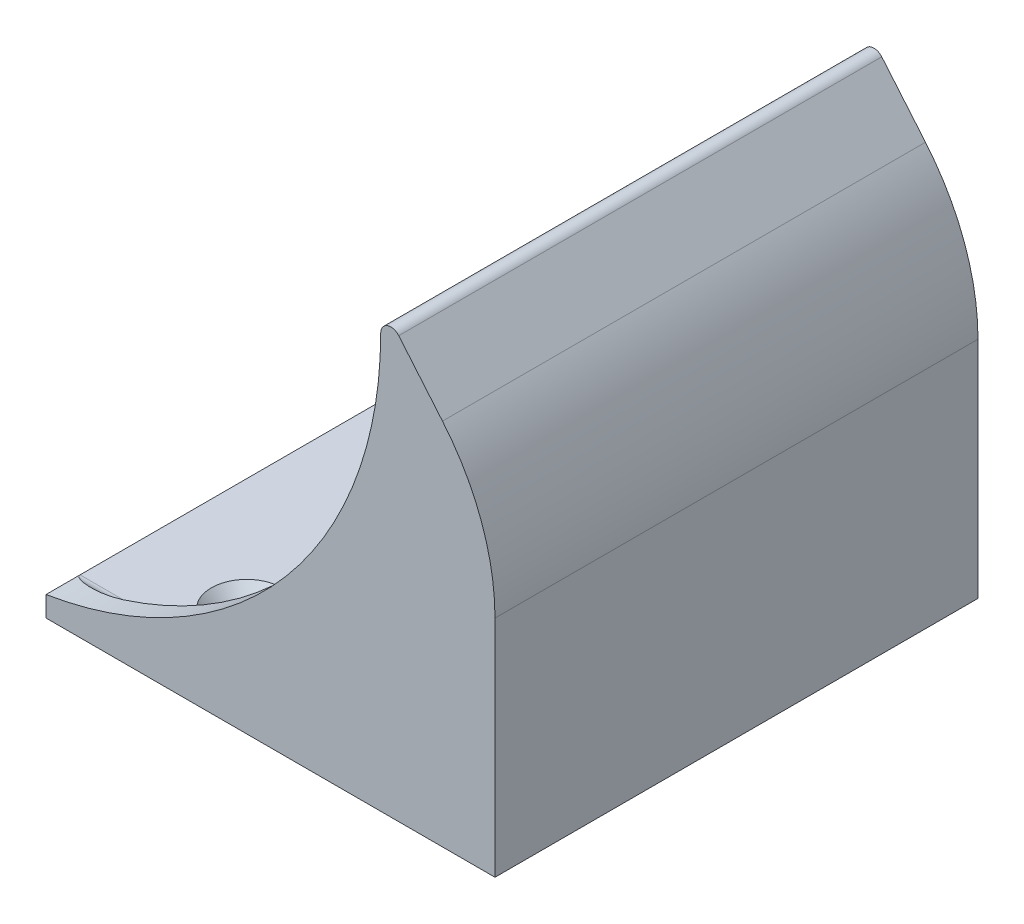
ISO-10303-21;
HEADER;
FILE_DESCRIPTION(('STEP AP214'),'2;1');
FILE_NAME('part.step','',(''),(''),'','','');
FILE_SCHEMA(('AUTOMOTIVE_DESIGN { 1 0 10303 214 1 1 1 1 }'));
ENDSEC;
DATA;
#1=APPLICATION_CONTEXT('core data for automotive mechanical design processes');
#2=APPLICATION_PROTOCOL_DEFINITION('international standard','automotive_design',2000,#1);
#3=PRODUCT_CONTEXT('',#1,'mechanical');
#4=PRODUCT('Part','Part','',(#3));
#5=PRODUCT_RELATED_PRODUCT_CATEGORY('part','',(#4));
#6=PRODUCT_DEFINITION_FORMATION('','',#4);
#7=PRODUCT_DEFINITION_CONTEXT('part definition',#1,'design');
#8=PRODUCT_DEFINITION('design','',#6,#7);
#9=PRODUCT_DEFINITION_SHAPE('','',#8);
#10=(LENGTH_UNIT() NAMED_UNIT(*) SI_UNIT(.MILLI.,.METRE.));
#11=(NAMED_UNIT(*) PLANE_ANGLE_UNIT() SI_UNIT($,.RADIAN.));
#12=(NAMED_UNIT(*) SI_UNIT($,.STERADIAN.) SOLID_ANGLE_UNIT());
#13=UNCERTAINTY_MEASURE_WITH_UNIT(LENGTH_MEASURE(1.E-05),#10,'distance_accuracy_value','');
#14=(GEOMETRIC_REPRESENTATION_CONTEXT(3) GLOBAL_UNCERTAINTY_ASSIGNED_CONTEXT((#13)) GLOBAL_UNIT_ASSIGNED_CONTEXT((#10,
#11,#12)) REPRESENTATION_CONTEXT('',''));
#15=CARTESIAN_POINT('',(0.,0.,0.));
#16=DIRECTION('',(0.,0.,1.));
#17=DIRECTION('',(1.,0.,0.));
#18=AXIS2_PLACEMENT_3D('',#15,#16,#17);
#19=CARTESIAN_POINT('',(0.,0.,32.5));
#20=DIRECTION('',(0.,0.,-1.));
#21=DIRECTION('',(-1.,0.,0.));
#22=AXIS2_PLACEMENT_3D('',#19,#20,#21);
#23=CYLINDRICAL_SURFACE('',#22,30.);
#24=DIRECTION('',(0.,0.,-1.));
#25=VECTOR('',#24,1.);
#26=CARTESIAN_POINT('',(0.,-30.,32.5));
#27=LINE('',#26,#25);
#28=CARTESIAN_POINT('',(0.,-30.,30.5));
#29=VERTEX_POINT('',#28);
#30=CARTESIAN_POINT('',(0.,-30.,-30.5));
#31=VERTEX_POINT('',#30);
#32=EDGE_CURVE('E351',#29,#31,#27,.T.);
#33=ORIENTED_EDGE('',*,*,#32,.F.);
#34=CARTESIAN_POINT('',(0.,0.,30.5));
#35=DIRECTION('',(0.,0.,1.));
#36=DIRECTION('',(1.,0.,0.));
#37=AXIS2_PLACEMENT_3D('',#34,#35,#36);
#38=CIRCLE('',#37,30.);
#39=CARTESIAN_POINT('',(22.9813332935692,19.2836282905963,30.5));
#40=VERTEX_POINT('',#39);
#41=EDGE_CURVE('E373',#29,#40,#38,.T.);
#42=ORIENTED_EDGE('',*,*,#41,.T.);
#43=DIRECTION('',(0.,0.,-1.));
#44=VECTOR('',#43,1.);
#45=CARTESIAN_POINT('',(22.9813332935692,19.2836282905963,32.5));
#46=LINE('',#45,#44);
#47=CARTESIAN_POINT('',(22.9813332935692,19.2836282905963,-30.5));
#48=VERTEX_POINT('',#47);
#49=EDGE_CURVE('E328',#40,#48,#46,.T.);
#50=ORIENTED_EDGE('',*,*,#49,.T.);
#51=CARTESIAN_POINT('',(0.,0.,-30.5));
#52=DIRECTION('',(0.,0.,1.));
#53=DIRECTION('',(1.,0.,0.));
#54=AXIS2_PLACEMENT_3D('',#51,#52,#53);
#55=CIRCLE('',#54,30.);
#56=EDGE_CURVE('E218',#31,#48,#55,.T.);
#57=ORIENTED_EDGE('',*,*,#56,.F.);
#58=EDGE_LOOP('',(#33,#42,#50,#57));
#59=FACE_BOUND('',#58,.T.);
#60=ADVANCED_FACE('F38',(#59),#23,.F.);
#61=CARTESIAN_POINT('',(-33.,-30.,32.5));
#62=DIRECTION('',(0.,-1.,0.));
#63=DIRECTION('',(0.,0.,-1.));
#64=AXIS2_PLACEMENT_3D('',#61,#62,#63);
#65=PLANE('',#64);
#66=CARTESIAN_POINT('',(-16.5,-30.,22.5));
#67=DIRECTION('',(0.,1.,0.));
#68=DIRECTION('',(0.,0.,1.));
#69=AXIS2_PLACEMENT_3D('',#66,#67,#68);
#70=CIRCLE('',#69,5.2);
#71=CARTESIAN_POINT('',(-16.5,-30.,27.7));
#72=VERTEX_POINT('',#71);
#73=EDGE_CURVE('E280',#72,#72,#70,.T.);
#74=ORIENTED_EDGE('',*,*,#73,.F.);
#75=EDGE_LOOP('',(#74));
#76=FACE_BOUND('',#75,.T.);
#77=DIRECTION('',(0.,0.,-1.));
#78=VECTOR('',#77,1.);
#79=CARTESIAN_POINT('',(-33.,-30.,32.5));
#80=LINE('',#79,#78);
#81=CARTESIAN_POINT('',(-33.,-30.,30.5));
#82=VERTEX_POINT('',#81);
#83=CARTESIAN_POINT('',(-33.,-30.,-30.5));
#84=VERTEX_POINT('',#83);
#85=EDGE_CURVE('E185',#82,#84,#80,.T.);
#86=ORIENTED_EDGE('',*,*,#85,.F.);
#87=DIRECTION('',(-1.,0.,0.));
#88=VECTOR('',#87,1.);
#89=CARTESIAN_POINT('',(0.,-30.,30.5));
#90=LINE('',#89,#88);
#91=EDGE_CURVE('E370',#82,#29,#90,.F.);
#92=ORIENTED_EDGE('',*,*,#91,.T.);
#93=ORIENTED_EDGE('',*,*,#32,.T.);
#94=DIRECTION('',(-1.,0.,0.));
#95=VECTOR('',#94,1.);
#96=CARTESIAN_POINT('',(0.,-30.,-30.5));
#97=LINE('',#96,#95);
#98=EDGE_CURVE('E214',#84,#31,#97,.F.);
#99=ORIENTED_EDGE('',*,*,#98,.F.);
#100=EDGE_LOOP('',(#86,#92,#93,#99));
#101=FACE_BOUND('',#100,.T.);
#102=CARTESIAN_POINT('',(-16.5,-30.,-22.5));
#103=DIRECTION('',(0.,-1.,0.));
#104=DIRECTION('',(0.,0.,-1.));
#105=AXIS2_PLACEMENT_3D('',#102,#103,#104);
#106=CIRCLE('',#105,5.2);
#107=CARTESIAN_POINT('',(-16.5,-30.,-27.7));
#108=VERTEX_POINT('',#107);
#109=EDGE_CURVE('E279',#108,#108,#106,.T.);
#110=ORIENTED_EDGE('',*,*,#109,.T.);
#111=EDGE_LOOP('',(#110));
#112=FACE_BOUND('',#111,.T.);
#113=ADVANCED_FACE('F457',(#76,#101,#112),#65,.F.);
#114=CARTESIAN_POINT('',(-33.,-33.,32.5));
#115=DIRECTION('',(1.,0.,0.));
#116=DIRECTION('',(0.,0.,-1.));
#117=AXIS2_PLACEMENT_3D('',#114,#115,#116);
#118=PLANE('',#117);
#119=ORIENTED_EDGE('',*,*,#85,.T.);
#120=DIRECTION('',(0.,0.,1.));
#121=VECTOR('',#120,1.);
#122=CARTESIAN_POINT('',(-33.,-30.,-35.5));
#123=LINE('',#122,#121);
#124=CARTESIAN_POINT('',(-33.,-30.,-35.5));
#125=VERTEX_POINT('',#124);
#126=EDGE_CURVE('E165',#125,#84,#123,.T.);
#127=ORIENTED_EDGE('',*,*,#126,.F.);
#128=DIRECTION('',(0.,-1.,0.));
#129=VECTOR('',#128,1.);
#130=CARTESIAN_POINT('',(-33.,-30.,-35.5));
#131=LINE('',#130,#129);
#132=CARTESIAN_POINT('',(-33.,-33.,-35.5));
#133=VERTEX_POINT('',#132);
#134=EDGE_CURVE('E173',#125,#133,#131,.T.);
#135=ORIENTED_EDGE('',*,*,#134,.T.);
#136=DIRECTION('',(0.,0.,-1.));
#137=VECTOR('',#136,1.);
#138=CARTESIAN_POINT('',(-33.,-33.,32.5));
#139=LINE('',#138,#137);
#140=CARTESIAN_POINT('',(-33.,-33.,35.5));
#141=VERTEX_POINT('',#140);
#142=EDGE_CURVE('E346',#141,#133,#139,.T.);
#143=ORIENTED_EDGE('',*,*,#142,.F.);
#144=DIRECTION('',(0.,-1.,0.));
#145=VECTOR('',#144,1.);
#146=CARTESIAN_POINT('',(-33.,-30.,35.5));
#147=LINE('',#146,#145);
#148=CARTESIAN_POINT('',(-33.,-30.,35.5));
#149=VERTEX_POINT('',#148);
#150=EDGE_CURVE('E297',#149,#141,#147,.T.);
#151=ORIENTED_EDGE('',*,*,#150,.F.);
#152=DIRECTION('',(0.,0.,-1.));
#153=VECTOR('',#152,1.);
#154=CARTESIAN_POINT('',(-33.,-30.,35.5));
#155=LINE('',#154,#153);
#156=EDGE_CURVE('E57',#149,#82,#155,.T.);
#157=ORIENTED_EDGE('',*,*,#156,.T.);
#158=EDGE_LOOP('',(#119,#127,#135,#143,#151,#157));
#159=FACE_BOUND('',#158,.T.);
#160=ADVANCED_FACE('F184',(#159),#118,.F.);
#161=CARTESIAN_POINT('',(33.,-33.,32.5));
#162=DIRECTION('',(0.,1.,0.));
#163=DIRECTION('',(-1.,0.,0.));
#164=AXIS2_PLACEMENT_3D('',#161,#162,#163);
#165=PLANE('',#164);
#166=CARTESIAN_POINT('',(-16.5,-33.,22.5));
#167=DIRECTION('',(0.,1.,0.));
#168=DIRECTION('',(0.,0.,1.));
#169=AXIS2_PLACEMENT_3D('',#166,#167,#168);
#170=CIRCLE('',#169,2.9);
#171=CARTESIAN_POINT('',(-16.5,-33.,25.4));
#172=VERTEX_POINT('',#171);
#173=EDGE_CURVE('E288',#172,#172,#170,.T.);
#174=ORIENTED_EDGE('',*,*,#173,.T.);
#175=EDGE_LOOP('',(#174));
#176=FACE_BOUND('',#175,.T.);
#177=ORIENTED_EDGE('',*,*,#142,.T.);
#178=DIRECTION('',(1.,0.,0.));
#179=VECTOR('',#178,1.);
#180=CARTESIAN_POINT('',(-33.,-33.,-35.5));
#181=LINE('',#180,#179);
#182=CARTESIAN_POINT('',(33.,-33.,-35.5));
#183=VERTEX_POINT('',#182);
#184=EDGE_CURVE('E181',#133,#183,#181,.T.);
#185=ORIENTED_EDGE('',*,*,#184,.T.);
#186=DIRECTION('',(0.,0.,-1.));
#187=VECTOR('',#186,1.);
#188=CARTESIAN_POINT('',(33.,-33.,32.5));
#189=LINE('',#188,#187);
#190=CARTESIAN_POINT('',(33.,-33.,35.5));
#191=VERTEX_POINT('',#190);
#192=EDGE_CURVE('E343',#191,#183,#189,.T.);
#193=ORIENTED_EDGE('',*,*,#192,.F.);
#194=DIRECTION('',(1.,0.,0.));
#195=VECTOR('',#194,1.);
#196=CARTESIAN_POINT('',(-33.,-33.,35.5));
#197=LINE('',#196,#195);
#198=EDGE_CURVE('E301',#141,#191,#197,.T.);
#199=ORIENTED_EDGE('',*,*,#198,.F.);
#200=EDGE_LOOP('',(#177,#185,#193,#199));
#201=FACE_BOUND('',#200,.T.);
#202=CARTESIAN_POINT('',(-16.5,-33.,-22.5));
#203=DIRECTION('',(0.,-1.,0.));
#204=DIRECTION('',(0.,0.,-1.));
#205=AXIS2_PLACEMENT_3D('',#202,#203,#204);
#206=CIRCLE('',#205,2.9);
#207=CARTESIAN_POINT('',(-16.5,-33.,-25.4));
#208=VERTEX_POINT('',#207);
#209=EDGE_CURVE('E463',#208,#208,#206,.T.);
#210=ORIENTED_EDGE('',*,*,#209,.F.);
#211=EDGE_LOOP('',(#210));
#212=FACE_BOUND('',#211,.T.);
#213=ADVANCED_FACE('F511',(#176,#201,#212),#165,.F.);
#214=CARTESIAN_POINT('',(33.,0.,32.5));
#215=DIRECTION('',(-1.,0.,0.));
#216=DIRECTION('',(0.,-1.,0.));
#217=AXIS2_PLACEMENT_3D('',#214,#215,#216);
#218=PLANE('',#217);
#219=ORIENTED_EDGE('',*,*,#192,.T.);
#220=DIRECTION('',(0.,1.,0.));
#221=VECTOR('',#220,1.);
#222=CARTESIAN_POINT('',(33.,-33.,-35.5));
#223=LINE('',#222,#221);
#224=CARTESIAN_POINT('',(33.,0.,-35.5));
#225=VERTEX_POINT('',#224);
#226=EDGE_CURVE('E479',#183,#225,#223,.T.);
#227=ORIENTED_EDGE('',*,*,#226,.T.);
#228=DIRECTION('',(0.,0.,-1.));
#229=VECTOR('',#228,1.);
#230=CARTESIAN_POINT('',(33.,0.,32.5));
#231=LINE('',#230,#229);
#232=CARTESIAN_POINT('',(33.,0.,35.5));
#233=VERTEX_POINT('',#232);
#234=EDGE_CURVE('E340',#233,#225,#231,.T.);
#235=ORIENTED_EDGE('',*,*,#234,.F.);
#236=DIRECTION('',(0.,1.,0.));
#237=VECTOR('',#236,1.);
#238=CARTESIAN_POINT('',(33.,-33.,35.5));
#239=LINE('',#238,#237);
#240=EDGE_CURVE('E305',#191,#233,#239,.T.);
#241=ORIENTED_EDGE('',*,*,#240,.F.);
#242=EDGE_LOOP('',(#219,#227,#235,#241));
#243=FACE_BOUND('',#242,.T.);
#244=ADVANCED_FACE('F514',(#243),#218,.F.);
#245=CARTESIAN_POINT('',(0.,0.,32.5));
#246=DIRECTION('',(0.,0.,-1.));
#247=DIRECTION('',(-1.,0.,0.));
#248=AXIS2_PLACEMENT_3D('',#245,#246,#247);
#249=CYLINDRICAL_SURFACE('',#248,33.);
#250=ORIENTED_EDGE('',*,*,#234,.T.);
#251=CARTESIAN_POINT('',(0.,0.,-35.5));
#252=DIRECTION('',(0.,0.,1.));
#253=DIRECTION('',(1.,0.,0.));
#254=AXIS2_PLACEMENT_3D('',#251,#252,#253);
#255=CIRCLE('',#254,33.);
#256=CARTESIAN_POINT('',(25.2794666229262,21.2119911196559,-35.5));
#257=VERTEX_POINT('',#256);
#258=EDGE_CURVE('E475',#225,#257,#255,.T.);
#259=ORIENTED_EDGE('',*,*,#258,.T.);
#260=DIRECTION('',(0.,0.,-1.));
#261=VECTOR('',#260,1.);
#262=CARTESIAN_POINT('',(25.2794666229261,21.2119911196559,32.5));
#263=LINE('',#262,#261);
#264=CARTESIAN_POINT('',(25.2794666229262,21.2119911196559,35.5));
#265=VERTEX_POINT('',#264);
#266=EDGE_CURVE('E337',#265,#257,#263,.T.);
#267=ORIENTED_EDGE('',*,*,#266,.F.);
#268=CARTESIAN_POINT('',(0.,0.,35.5));
#269=DIRECTION('',(0.,0.,1.));
#270=DIRECTION('',(1.,0.,0.));
#271=AXIS2_PLACEMENT_3D('',#268,#269,#270);
#272=CIRCLE('',#271,33.);
#273=EDGE_CURVE('E309',#233,#265,#272,.T.);
#274=ORIENTED_EDGE('',*,*,#273,.F.);
#275=EDGE_LOOP('',(#250,#259,#267,#274));
#276=FACE_BOUND('',#275,.T.);
#277=ADVANCED_FACE('F518',(#276),#249,.T.);
#278=CARTESIAN_POINT('',(25.2794666229261,21.2119911196559,32.5));
#279=DIRECTION('',(-0.766044443118974,-0.642787609686543,0.));
#280=DIRECTION('',(0.642787609686543,-0.766044443118975,0.));
#281=AXIS2_PLACEMENT_3D('',#278,#279,#280);
#282=PLANE('',#281);
#283=ORIENTED_EDGE('',*,*,#266,.T.);
#284=DIRECTION('',(-0.642787609686543,0.766044443118975,0.));
#285=VECTOR('',#284,1.);
#286=CARTESIAN_POINT('',(25.2794666229261,21.2119911196559,-35.5));
#287=LINE('',#286,#285);
#288=CARTESIAN_POINT('',(18.8515905260607,28.8724355508457,-35.5));
#289=VERTEX_POINT('',#288);
#290=EDGE_CURVE('E471',#257,#289,#287,.T.);
#291=ORIENTED_EDGE('',*,*,#290,.T.);
#292=DIRECTION('',(0.,0.,-1.));
#293=VECTOR('',#292,1.);
#294=CARTESIAN_POINT('',(18.8515905260607,28.8724355508457,32.5));
#295=LINE('',#294,#293);
#296=CARTESIAN_POINT('',(18.8515905260607,28.8724355508457,35.5));
#297=VERTEX_POINT('',#296);
#298=EDGE_CURVE('E334',#297,#289,#295,.T.);
#299=ORIENTED_EDGE('',*,*,#298,.F.);
#300=DIRECTION('',(-0.642787609686543,0.766044443118975,0.));
#301=VECTOR('',#300,1.);
#302=CARTESIAN_POINT('',(25.2794666229261,21.2119911196559,35.5));
#303=LINE('',#302,#301);
#304=EDGE_CURVE('E313',#265,#297,#303,.T.);
#305=ORIENTED_EDGE('',*,*,#304,.F.);
#306=EDGE_LOOP('',(#283,#291,#299,#305));
#307=FACE_BOUND('',#306,.T.);
#308=ADVANCED_FACE('F522',(#307),#282,.F.);
#309=CARTESIAN_POINT('',(17.7025238613823,27.9082541363159,32.5));
#310=DIRECTION('',(0.,0.,-1.));
#311=DIRECTION('',(-1.,0.,0.));
#312=AXIS2_PLACEMENT_3D('',#309,#310,#311);
#313=CYLINDRICAL_SURFACE('',#312,1.5);
#314=DIRECTION('',(0.,0.,-1.));
#315=VECTOR('',#314,1.);
#316=CARTESIAN_POINT('',(16.5534571967038,26.9440727217861,32.5));
#317=LINE('',#316,#315);
#318=CARTESIAN_POINT('',(16.5534571967038,26.9440727217861,30.5));
#319=VERTEX_POINT('',#318);
#320=CARTESIAN_POINT('',(16.5534571967038,26.9440727217861,-30.5));
#321=VERTEX_POINT('',#320);
#322=EDGE_CURVE('E331',#319,#321,#317,.T.);
#323=ORIENTED_EDGE('',*,*,#322,.F.);
#324=CARTESIAN_POINT('',(17.7025238613823,27.9082541363159,30.5));
#325=DIRECTION('',(0.,0.,1.));
#326=DIRECTION('',(1.,0.,0.));
#327=AXIS2_PLACEMENT_3D('',#324,#325,#326);
#328=CIRCLE('',#327,1.5);
#329=CARTESIAN_POINT('',(16.2025238613822,27.9082541363159,30.5));
#330=VERTEX_POINT('',#329);
#331=EDGE_CURVE('E354',#319,#330,#328,.F.);
#332=ORIENTED_EDGE('',*,*,#331,.T.);
#333=DIRECTION('',(0.,0.,-1.));
#334=VECTOR('',#333,1.);
#335=CARTESIAN_POINT('',(16.2025238613822,27.9082541363159,35.5));
#336=LINE('',#335,#334);
#337=CARTESIAN_POINT('',(16.2025238613822,27.9082541363159,35.5));
#338=VERTEX_POINT('',#337);
#339=EDGE_CURVE('E320',#338,#330,#336,.T.);
#340=ORIENTED_EDGE('',*,*,#339,.F.);
#341=CARTESIAN_POINT('',(17.7025238613823,27.9082541363159,35.5));
#342=DIRECTION('',(0.,0.,1.));
#343=DIRECTION('',(1.,0.,0.));
#344=AXIS2_PLACEMENT_3D('',#341,#342,#343);
#345=CIRCLE('',#344,1.5);
#346=EDGE_CURVE('E317',#297,#338,#345,.T.);
#347=ORIENTED_EDGE('',*,*,#346,.F.);
#348=ORIENTED_EDGE('',*,*,#298,.T.);
#349=CARTESIAN_POINT('',(17.7025238613823,27.9082541363159,-35.5));
#350=DIRECTION('',(0.,0.,1.));
#351=DIRECTION('',(1.,0.,0.));
#352=AXIS2_PLACEMENT_3D('',#349,#350,#351);
#353=CIRCLE('',#352,1.5);
#354=CARTESIAN_POINT('',(16.2025238613822,27.9082541363159,-35.5));
#355=VERTEX_POINT('',#354);
#356=EDGE_CURVE('E195',#289,#355,#353,.T.);
#357=ORIENTED_EDGE('',*,*,#356,.T.);
#358=DIRECTION('',(0.,0.,1.));
#359=VECTOR('',#358,1.);
#360=CARTESIAN_POINT('',(16.2025238613822,27.9082541363159,-35.5));
#361=LINE('',#360,#359);
#362=CARTESIAN_POINT('',(16.2025238613822,27.9082541363159,-30.5));
#363=VERTEX_POINT('',#362);
#364=EDGE_CURVE('E168',#355,#363,#361,.T.);
#365=ORIENTED_EDGE('',*,*,#364,.T.);
#366=CARTESIAN_POINT('',(17.7025238613823,27.9082541363159,-30.5));
#367=DIRECTION('',(0.,0.,1.));
#368=DIRECTION('',(1.,0.,0.));
#369=AXIS2_PLACEMENT_3D('',#366,#367,#368);
#370=CIRCLE('',#369,1.5);
#371=EDGE_CURVE('E188',#321,#363,#370,.F.);
#372=ORIENTED_EDGE('',*,*,#371,.F.);
#373=EDGE_LOOP('',(#323,#332,#340,#347,#348,#357,#365,#372));
#374=FACE_BOUND('',#373,.T.);
#375=ADVANCED_FACE('F439',(#374),#313,.T.);
#376=CARTESIAN_POINT('',(22.9813332935692,19.2836282905963,32.5));
#377=DIRECTION('',(0.766044443118974,0.642787609686544,0.));
#378=DIRECTION('',(-0.642787609686544,0.766044443118974,0.));
#379=AXIS2_PLACEMENT_3D('',#376,#377,#378);
#380=PLANE('',#379);
#381=ORIENTED_EDGE('',*,*,#49,.F.);
#382=DIRECTION('',(0.642787609686544,-0.766044443118974,0.));
#383=VECTOR('',#382,1.);
#384=CARTESIAN_POINT('',(16.5534571967038,26.9440727217861,30.5));
#385=LINE('',#384,#383);
#386=EDGE_CURVE('E367',#40,#319,#385,.F.);
#387=ORIENTED_EDGE('',*,*,#386,.T.);
#388=ORIENTED_EDGE('',*,*,#322,.T.);
#389=DIRECTION('',(0.642787609686544,-0.766044443118974,0.));
#390=VECTOR('',#389,1.);
#391=CARTESIAN_POINT('',(16.5534571967038,26.9440727217861,-30.5));
#392=LINE('',#391,#390);
#393=EDGE_CURVE('E210',#48,#321,#392,.F.);
#394=ORIENTED_EDGE('',*,*,#393,.F.);
#395=EDGE_LOOP('',(#381,#387,#388,#394));
#396=FACE_BOUND('',#395,.T.);
#397=ADVANCED_FACE('F400',(#396),#380,.F.);
#398=CARTESIAN_POINT('',(-42.4759116972664,27.9082541363153,32.5));
#399=DIRECTION('',(0.,0.,1.));
#400=DIRECTION('',(1.,0.,0.));
#401=AXIS2_PLACEMENT_3D('',#398,#399,#400);
#402=PLANE('',#401);
#403=CARTESIAN_POINT('',(-42.4759116972664,27.9082541363153,32.5));
#404=DIRECTION('',(0.,0.,-1.));
#405=DIRECTION('',(1.,0.,0.));
#406=AXIS2_PLACEMENT_3D('',#403,#404,#405);
#407=CIRCLE('',#406,58.6784355586486);
#408=CARTESIAN_POINT('',(16.0962059800786,24.3775558481964,32.5));
#409=VERTEX_POINT('',#408);
#410=CARTESIAN_POINT('',(-24.6594608992075,-28.,32.5));
#411=VERTEX_POINT('',#410);
#412=EDGE_CURVE('E292',#409,#411,#407,.T.);
#413=ORIENTED_EDGE('',*,*,#412,.F.);
#414=DIRECTION('',(0.642787609686544,-0.766044443118974,0.));
#415=VECTOR('',#414,1.);
#416=CARTESIAN_POINT('',(21.4492444073313,17.9980530712232,32.5));
#417=LINE('',#416,#415);
#418=CARTESIAN_POINT('',(21.4492444073313,17.9980530712232,32.5));
#419=VERTEX_POINT('',#418);
#420=EDGE_CURVE('E364',#409,#419,#417,.T.);
#421=ORIENTED_EDGE('',*,*,#420,.T.);
#422=CARTESIAN_POINT('',(0.,0.,32.5));
#423=DIRECTION('',(0.,0.,1.));
#424=DIRECTION('',(1.,0.,0.));
#425=AXIS2_PLACEMENT_3D('',#422,#423,#424);
#426=CIRCLE('',#425,28.);
#427=CARTESIAN_POINT('',(0.,-28.,32.5));
#428=VERTEX_POINT('',#427);
#429=EDGE_CURVE('E358',#419,#428,#426,.F.);
#430=ORIENTED_EDGE('',*,*,#429,.T.);
#431=DIRECTION('',(-1.,0.,0.));
#432=VECTOR('',#431,1.);
#433=CARTESIAN_POINT('',(-33.,-28.,32.5));
#434=LINE('',#433,#432);
#435=EDGE_CURVE('E361',#428,#411,#434,.T.);
#436=ORIENTED_EDGE('',*,*,#435,.T.);
#437=EDGE_LOOP('',(#413,#421,#430,#436));
#438=FACE_BOUND('',#437,.T.);
#439=ADVANCED_FACE('F398',(#438),#402,.F.);
#440=CARTESIAN_POINT('',(-42.4759116972664,27.9082541363153,35.5));
#441=DIRECTION('',(0.,0.,-1.));
#442=DIRECTION('',(-1.,0.,0.));
#443=AXIS2_PLACEMENT_3D('',#440,#441,#442);
#444=CYLINDRICAL_SURFACE('',#443,58.6784355586486);
#445=CARTESIAN_POINT('',(16.1887746663543,26.638067745073,31.7952237412611));
#446=CARTESIAN_POINT('',(16.1919317769759,26.78492512722,31.6813296232784));
#447=CARTESIAN_POINT('',(16.1944187222962,26.9241931934652,31.5587856697288));
#448=CARTESIAN_POINT('',(16.1983001305675,27.1912569114252,31.3025133591723));
#449=CARTESIAN_POINT('',(16.1996983697774,27.3190908448796,31.1688254587548));
#450=CARTESIAN_POINT('',(16.2019232292519,27.6001120997677,30.8601944854421));
#451=CARTESIAN_POINT('',(16.2025087742243,27.7513149498043,30.6835176584587));
#452=CARTESIAN_POINT('',(16.2025237631909,27.9043787396116,30.5045317570219));
#453=CARTESIAN_POINT('',(16.2025238591137,27.9063164386798,30.5022658771492));
#454=CARTESIAN_POINT('',(16.2025238613822,27.9082541363159,30.5));
#455=B_SPLINE_CURVE_WITH_KNOTS('',3,(#445,#446,#447,#448,#449,#450,#451,#452,#453,#454),
.UNSPECIFIED.,.F.,.F.,(4,2,2,2,4),(0.,0.55627596106504,1.11061373385675,1.80819570302728,
1.8171399749413),.UNSPECIFIED.);
#456=CARTESIAN_POINT('',(16.1887746663543,26.638067745073,31.7952237412611));
#457=VERTEX_POINT('',#456);
#458=EDGE_CURVE('E65',#330,#457,#455,.F.);
#459=ORIENTED_EDGE('',*,*,#458,.T.);
#460=CARTESIAN_POINT('',(16.0962059800786,24.3775558481964,32.5));
#461=CARTESIAN_POINT('',(16.103237127742,24.4941431003819,32.4999704314278));
#462=CARTESIAN_POINT('',(16.1099137249115,24.6107533282519,32.4951593696277));
#463=CARTESIAN_POINT('',(16.122541738009,24.8433664883267,32.4759375554339));
#464=CARTESIAN_POINT('',(16.128492230496,24.9593684712857,32.4615147265301));
#465=CARTESIAN_POINT('',(16.1397391880877,25.1919872384851,32.4226697576414));
#466=CARTESIAN_POINT('',(16.1450212032378,25.3085743628238,32.3980641779542));
#467=CARTESIAN_POINT('',(16.1547888044831,25.539064526504,32.3386123207188));
#468=CARTESIAN_POINT('',(16.1592748842811,25.652969191422,32.3037724271827));
#469=CARTESIAN_POINT('',(16.1689050769253,25.9164771102821,32.209238951298));
#470=CARTESIAN_POINT('',(16.173725561003,26.0645434646738,32.1451137512217));
#471=CARTESIAN_POINT('',(16.1819595588539,26.348489025437,31.9961818372697));
#472=CARTESIAN_POINT('',(16.1853854924992,26.4844669859034,31.9115688941983));
#473=CARTESIAN_POINT('',(16.1901585654662,26.7004054602492,31.7483713860685));
#474=CARTESIAN_POINT('',(16.1918210472443,26.7848291651993,31.6757730571626));
#475=CARTESIAN_POINT('',(16.1939251016311,26.9029543249776,31.5576046873467));
#476=CARTESIAN_POINT('',(16.1945636783316,26.9410776575886,31.5164436641584));
#477=CARTESIAN_POINT('',(16.195717481668,27.0137923065324,31.4310022194713));
#478=CARTESIAN_POINT('',(16.1962325053971,27.0483777600305,31.3867168191556));
#479=CARTESIAN_POINT('',(16.1966905047362,27.0808784924682,31.3408859891066));
#480=B_SPLINE_CURVE_WITH_KNOTS('',3,(#460,#461,#462,#463,#464,#465,#466,#467,#468,#469,#470,
#471,#472,#473,#474,#475,#476,#477,#478,#479),.UNSPECIFIED.,.F.,.F.,(4,2,2,2,2,2,2,2,2,4),(0.,
0.350301783304062,0.701044528064303,1.05840164629202,1.41553632214221,1.89829854325755,
2.37666190950394,2.70961046664077,2.87775234843452,3.04616850192107),.UNSPECIFIED.);
#481=EDGE_CURVE('E49',#457,#409,#480,.F.);
#482=ORIENTED_EDGE('',*,*,#481,.T.);
#483=ORIENTED_EDGE('',*,*,#412,.T.);
#484=CARTESIAN_POINT('',(-24.6594608992075,-28.,32.5));
#485=CARTESIAN_POINT('',(-24.8165055564305,-28.0500463095388,32.4999907461538));
#486=CARTESIAN_POINT('',(-24.9737557523478,-28.0994283943959,32.4981216482181));
#487=CARTESIAN_POINT('',(-25.2885848134156,-28.1968412823042,32.490891297076));
#488=CARTESIAN_POINT('',(-25.4461636588423,-28.2448721640762,32.485530247751));
#489=CARTESIAN_POINT('',(-25.7617062800705,-28.3396017816286,32.4715381374165));
#490=CARTESIAN_POINT('',(-25.9196702578196,-28.3862994731818,32.4629045848856));
#491=CARTESIAN_POINT('',(-26.2358007426248,-28.4783107616145,32.442533820971));
#492=CARTESIAN_POINT('',(-26.3939672532368,-28.5236243338353,32.4307965543292));
#493=CARTESIAN_POINT('',(-26.8786866012684,-28.6602919020524,32.3903035609246));
#494=CARTESIAN_POINT('',(-27.2054903141191,-28.749377783955,32.356720929247));
#495=CARTESIAN_POINT('',(-27.8589531398578,-28.9214688282911,32.2775976602036));
#496=CARTESIAN_POINT('',(-28.1856121657011,-29.0044786958019,32.232066403496));
#497=CARTESIAN_POINT('',(-28.8371382545568,-29.1641089155717,32.1290684769905));
#498=CARTESIAN_POINT('',(-29.1620070472614,-29.2407548419355,32.0716531774491));
#499=CARTESIAN_POINT('',(-29.6487389105971,-29.3512449397234,31.9753026031985));
#500=CARTESIAN_POINT('',(-29.8110969240336,-29.3873722510058,31.9414307649789));
#501=CARTESIAN_POINT('',(-30.1352825435333,-29.4580703252074,31.8698779262575));
#502=CARTESIAN_POINT('',(-30.2971102487718,-29.492641396627,31.8321976855618));
#503=CARTESIAN_POINT('',(-30.6175473978852,-29.5596880011927,31.7530074819323));
#504=CARTESIAN_POINT('',(-30.7761682927682,-29.5921874467662,31.7115646632969));
#505=CARTESIAN_POINT('',(-31.0923730390068,-29.655622327835,31.6233296962357));
#506=CARTESIAN_POINT('',(-31.2499560069877,-29.6865565513651,31.5765334913636));
#507=CARTESIAN_POINT('',(-31.5625873257474,-29.7466096992774,31.4761158257314));
#508=CARTESIAN_POINT('',(-31.7176436219168,-29.7757358054489,31.4225243363477));
#509=CARTESIAN_POINT('',(-31.9473926072343,-29.8179544727606,31.3343169710915));
#510=CARTESIAN_POINT('',(-32.0234573511253,-29.8317742730206,31.3036323216712));
#511=CARTESIAN_POINT('',(-32.1742057440923,-29.8588602149917,31.238838769026));
#512=CARTESIAN_POINT('',(-32.2488900019179,-29.8721266041475,31.2047314199252));
#513=CARTESIAN_POINT('',(-32.3472124596803,-29.8894005361165,31.1559973220716));
#514=CARTESIAN_POINT('',(-32.371836300754,-29.8937101629755,31.1434630316946));
#515=CARTESIAN_POINT('',(-32.4207792958185,-29.9022442983076,31.1177783123585));
#516=CARTESIAN_POINT('',(-32.4450984009236,-29.9064687931883,31.104627786107));
#517=CARTESIAN_POINT('',(-32.5176455708029,-29.9190243989509,31.0640497691822));
#518=CARTESIAN_POINT('',(-32.5653233347769,-29.9272130215962,31.0355640301147));
#519=CARTESIAN_POINT('',(-32.6616921911821,-29.9436469224977,30.9726271081862));
#520=CARTESIAN_POINT('',(-32.710206137185,-29.951853265593,30.9378931567963));
#521=CARTESIAN_POINT('',(-32.8022943618377,-29.9673197544276,30.8621585219731));
#522=CARTESIAN_POINT('',(-32.8458911528369,-29.974584237273,30.8211886007062));
#523=CARTESIAN_POINT('',(-32.8998807913317,-29.9835302387786,30.7568197664721));
#524=CARTESIAN_POINT('',(-32.9146985509182,-29.9859786815137,30.7372976457857));
#525=CARTESIAN_POINT('',(-32.9417199290961,-29.9904347189816,30.6964493620696));
#526=CARTESIAN_POINT('',(-32.9539260430702,-29.9924427345814,30.6751249485301));
#527=CARTESIAN_POINT('',(-32.9728139378367,-29.9955454627896,30.6346589812807));
#528=CARTESIAN_POINT('',(-32.9800932248271,-29.9967392751431,30.6158087587956));
#529=CARTESIAN_POINT('',(-32.9914656712257,-29.9986031326852,30.5771655248477));
#530=CARTESIAN_POINT('',(-32.9955679133164,-29.9992746709984,30.5573753739404));
#531=CARTESIAN_POINT('',(-32.9992904514928,-29.9998838743184,30.5249769712209));
#532=CARTESIAN_POINT('',(-33.0000205144383,-30.000003275767,30.5124915076965));
#533=CARTESIAN_POINT('',(-32.9999999999998,-30.,30.5));
#534=B_SPLINE_CURVE_WITH_KNOTS('',3,(#484,#485,#486,#487,#488,#489,#490,#491,#492,#493,#494,
#495,#496,#497,#498,#499,#500,#501,#502,#503,#504,#505,#506,#507,#508,#509,#510,#511,#512,#513,
#514,#515,#516,#517,#518,#519,#520,#521,#522,#523,#524,#525,#526,#527,#528,#529,#530,#531,#532,
#533),.UNSPECIFIED.,.F.,.F.,(4,2,2,2,2,2,2,2,2,2,2,2,2,2,2,2,2,2,2,2,2,2,2,2,4),(0.,
0.494457894439747,0.988886922014232,1.48369314185197,1.97850817171698,2.9993721017935,
4.01943695460197,5.03518123927712,5.5443701083022,6.05345758993452,6.55478373462774,
7.05649229959797,7.55606035345989,7.80553928036291,8.05490543611169,8.13879121153571,
8.22269027590248,8.39096128937279,8.57143213654908,8.75103996189499,8.82478397161676,
8.89845720239346,8.95895905377903,9.01928729457376,9.0567353181515),.UNSPECIFIED.);
#535=EDGE_CURVE('E11',#411,#82,#534,.T.);
#536=ORIENTED_EDGE('',*,*,#535,.T.);
#537=ORIENTED_EDGE('',*,*,#156,.F.);
#538=CARTESIAN_POINT('',(-42.4759116972664,27.9082541363153,35.5));
#539=DIRECTION('',(0.,0.,-1.));
#540=DIRECTION('',(1.,0.,0.));
#541=AXIS2_PLACEMENT_3D('',#538,#539,#540);
#542=CIRCLE('',#541,58.6784355586486);
#543=EDGE_CURVE('E293',#338,#149,#542,.T.);
#544=ORIENTED_EDGE('',*,*,#543,.F.);
#545=ORIENTED_EDGE('',*,*,#339,.T.);
#546=EDGE_LOOP('',(#459,#482,#483,#536,#537,#544,#545));
#547=FACE_BOUND('',#546,.T.);
#548=ADVANCED_FACE('F392',(#547),#444,.F.);
#549=CARTESIAN_POINT('',(-42.4759116972664,27.9082541363153,35.5));
#550=DIRECTION('',(0.,0.,1.));
#551=DIRECTION('',(1.,0.,0.));
#552=AXIS2_PLACEMENT_3D('',#549,#550,#551);
#553=PLANE('',#552);
#554=ORIENTED_EDGE('',*,*,#543,.T.);
#555=ORIENTED_EDGE('',*,*,#150,.T.);
#556=ORIENTED_EDGE('',*,*,#198,.T.);
#557=ORIENTED_EDGE('',*,*,#240,.T.);
#558=ORIENTED_EDGE('',*,*,#273,.T.);
#559=ORIENTED_EDGE('',*,*,#304,.T.);
#560=ORIENTED_EDGE('',*,*,#346,.T.);
#561=EDGE_LOOP('',(#554,#555,#556,#557,#558,#559,#560));
#562=FACE_BOUND('',#561,.T.);
#563=ADVANCED_FACE('F397',(#562),#553,.T.);
#564=CARTESIAN_POINT('',(-16.5,-30.,22.5));
#565=DIRECTION('',(0.,1.,0.));
#566=DIRECTION('',(0.,0.,1.));
#567=AXIS2_PLACEMENT_3D('',#564,#565,#566);
#568=CYLINDRICAL_SURFACE('',#567,2.89999999999999);
#569=ORIENTED_EDGE('',*,*,#173,.F.);
#570=EDGE_LOOP('',(#569));
#571=FACE_BOUND('',#570,.T.);
#572=CARTESIAN_POINT('',(-16.5,-32.3,22.5));
#573=DIRECTION('',(0.,1.,0.));
#574=DIRECTION('',(0.,0.,1.));
#575=AXIS2_PLACEMENT_3D('',#572,#573,#574);
#576=CIRCLE('',#575,2.89999999999999);
#577=CARTESIAN_POINT('',(-16.5,-32.3,25.4));
#578=VERTEX_POINT('',#577);
#579=EDGE_CURVE('E284',#578,#578,#576,.T.);
#580=ORIENTED_EDGE('',*,*,#579,.T.);
#581=EDGE_LOOP('',(#580));
#582=FACE_BOUND('',#581,.T.);
#583=ADVANCED_FACE('F550',(#571,#582),#568,.F.);
#584=CARTESIAN_POINT('',(-16.5,-30.,22.5));
#585=DIRECTION('',(0.,1.,0.));
#586=DIRECTION('',(0.,0.,1.));
#587=AXIS2_PLACEMENT_3D('',#584,#585,#586);
#588=CONICAL_SURFACE('',#587,5.2,0.785398163397451);
#589=ORIENTED_EDGE('',*,*,#579,.F.);
#590=EDGE_LOOP('',(#589));
#591=FACE_BOUND('',#590,.T.);
#592=ORIENTED_EDGE('',*,*,#73,.T.);
#593=EDGE_LOOP('',(#592));
#594=FACE_BOUND('',#593,.T.);
#595=ADVANCED_FACE('F260',(#591,#594),#588,.F.);
#596=CARTESIAN_POINT('',(-42.4759116972664,-28.,30.5));
#597=DIRECTION('',(1.,0.,0.));
#598=DIRECTION('',(0.,0.,-1.));
#599=AXIS2_PLACEMENT_3D('',#596,#597,#598);
#600=CYLINDRICAL_SURFACE('',#599,2.);
#601=ORIENTED_EDGE('',*,*,#535,.F.);
#602=ORIENTED_EDGE('',*,*,#435,.F.);
#603=CARTESIAN_POINT('',(0.,-28.,30.5));
#604=DIRECTION('',(-1.,0.,0.));
#605=DIRECTION('',(0.,0.,1.));
#606=AXIS2_PLACEMENT_3D('',#603,#604,#605);
#607=CIRCLE('',#606,2.);
#608=EDGE_CURVE('E43',#29,#428,#607,.T.);
#609=ORIENTED_EDGE('',*,*,#608,.F.);
#610=ORIENTED_EDGE('',*,*,#91,.F.);
#611=EDGE_LOOP('',(#601,#602,#609,#610));
#612=FACE_BOUND('',#611,.T.);
#613=ADVANCED_FACE('F40',(#612),#600,.F.);
#614=CARTESIAN_POINT('',(0.,0.,30.5));
#615=DIRECTION('',(0.,0.,1.));
#616=DIRECTION('',(1.,0.,0.));
#617=AXIS2_PLACEMENT_3D('',#614,#615,#616);
#618=TOROIDAL_SURFACE('',#617,28.,2.);
#619=ORIENTED_EDGE('',*,*,#608,.T.);
#620=ORIENTED_EDGE('',*,*,#429,.F.);
#621=CARTESIAN_POINT('',(21.4492444073313,17.9980530712232,30.5));
#622=DIRECTION('',(0.642787609686543,-0.766044443118975,0.));
#623=DIRECTION('',(0.766044443118975,0.642787609686543,0.));
#624=AXIS2_PLACEMENT_3D('',#621,#622,#623);
#625=CIRCLE('',#624,2.);
#626=EDGE_CURVE('E411',#40,#419,#625,.T.);
#627=ORIENTED_EDGE('',*,*,#626,.F.);
#628=ORIENTED_EDGE('',*,*,#41,.F.);
#629=EDGE_LOOP('',(#619,#620,#627,#628));
#630=FACE_BOUND('',#629,.T.);
#631=ADVANCED_FACE('F424',(#630),#618,.F.);
#632=CARTESIAN_POINT('',(-9.84291163405551,55.2905924535641,30.5));
#633=DIRECTION('',(-0.642787609686544,0.766044443118974,0.));
#634=DIRECTION('',(-0.766044443118974,-0.642787609686544,0.));
#635=AXIS2_PLACEMENT_3D('',#632,#633,#634);
#636=CYLINDRICAL_SURFACE('',#635,2.);
#637=ORIENTED_EDGE('',*,*,#420,.F.);
#638=ORIENTED_EDGE('',*,*,#481,.F.);
#639=CARTESIAN_POINT('',(15.0213683104658,25.658497502413,30.5));
#640=DIRECTION('',(0.642787609686545,-0.766044443118974,0.));
#641=DIRECTION('',(0.766044443118974,0.642787609686545,0.));
#642=AXIS2_PLACEMENT_3D('',#639,#640,#641);
#643=CIRCLE('',#642,2.);
#644=EDGE_CURVE('E269',#319,#457,#643,.T.);
#645=ORIENTED_EDGE('',*,*,#644,.F.);
#646=ORIENTED_EDGE('',*,*,#386,.F.);
#647=ORIENTED_EDGE('',*,*,#626,.T.);
#648=EDGE_LOOP('',(#637,#638,#645,#646,#647));
#649=FACE_BOUND('',#648,.T.);
#650=ADVANCED_FACE('F433',(#649),#636,.F.);
#651=CARTESIAN_POINT('',(17.7025238613823,27.9082541363159,30.5));
#652=DIRECTION('',(0.,0.,1.));
#653=DIRECTION('',(1.,0.,0.));
#654=AXIS2_PLACEMENT_3D('',#651,#652,#653);
#655=TOROIDAL_SURFACE('',#654,3.5,2.);
#656=ORIENTED_EDGE('',*,*,#458,.F.);
#657=ORIENTED_EDGE('',*,*,#331,.F.);
#658=ORIENTED_EDGE('',*,*,#644,.T.);
#659=EDGE_LOOP('',(#656,#657,#658));
#660=FACE_BOUND('',#659,.T.);
#661=ADVANCED_FACE('F389',(#660),#655,.F.);
#662=CARTESIAN_POINT('',(-42.4759116972664,27.9082541363153,-32.5));
#663=DIRECTION('',(0.,0.,-1.));
#664=DIRECTION('',(1.,0.,0.));
#665=AXIS2_PLACEMENT_3D('',#662,#663,#664);
#666=PLANE('',#665);
#667=CARTESIAN_POINT('',(-42.4759116972664,27.9082541363153,-32.5));
#668=DIRECTION('',(0.,0.,-1.));
#669=DIRECTION('',(1.,0.,0.));
#670=AXIS2_PLACEMENT_3D('',#667,#668,#669);
#671=CIRCLE('',#670,58.6784355586486);
#672=CARTESIAN_POINT('',(16.0962059800786,24.3775558481964,-32.5));
#673=VERTEX_POINT('',#672);
#674=CARTESIAN_POINT('',(-24.6594608992075,-28.,-32.5));
#675=VERTEX_POINT('',#674);
#676=EDGE_CURVE('E174',#673,#675,#671,.T.);
#677=ORIENTED_EDGE('',*,*,#676,.T.);
#678=DIRECTION('',(-1.,0.,0.));
#679=VECTOR('',#678,1.);
#680=CARTESIAN_POINT('',(-33.,-28.,-32.5));
#681=LINE('',#680,#679);
#682=CARTESIAN_POINT('',(0.,-28.,-32.5));
#683=VERTEX_POINT('',#682);
#684=EDGE_CURVE('E202',#683,#675,#681,.T.);
#685=ORIENTED_EDGE('',*,*,#684,.F.);
#686=CARTESIAN_POINT('',(0.,0.,-32.5));
#687=DIRECTION('',(0.,0.,1.));
#688=DIRECTION('',(1.,0.,0.));
#689=AXIS2_PLACEMENT_3D('',#686,#687,#688);
#690=CIRCLE('',#689,28.);
#691=CARTESIAN_POINT('',(21.4492444073313,17.9980530712232,-32.5));
#692=VERTEX_POINT('',#691);
#693=EDGE_CURVE('E193',#692,#683,#690,.F.);
#694=ORIENTED_EDGE('',*,*,#693,.F.);
#695=DIRECTION('',(0.642787609686544,-0.766044443118974,0.));
#696=VECTOR('',#695,1.);
#697=CARTESIAN_POINT('',(21.4492444073313,17.9980530712232,-32.5));
#698=LINE('',#697,#696);
#699=EDGE_CURVE('E206',#673,#692,#698,.T.);
#700=ORIENTED_EDGE('',*,*,#699,.F.);
#701=EDGE_LOOP('',(#677,#685,#694,#700));
#702=FACE_BOUND('',#701,.T.);
#703=ADVANCED_FACE('F570',(#702),#666,.F.);
#704=CARTESIAN_POINT('',(-42.4759116972664,27.9082541363153,-35.5));
#705=DIRECTION('',(0.,0.,1.));
#706=DIRECTION('',(-1.,0.,0.));
#707=AXIS2_PLACEMENT_3D('',#704,#705,#706);
#708=CYLINDRICAL_SURFACE('',#707,58.6784355586486);
#709=CARTESIAN_POINT('',(16.1887746663543,26.638067745073,-31.7952237412611));
#710=CARTESIAN_POINT('',(16.1919317769759,26.78492512722,-31.6813296232784));
#711=CARTESIAN_POINT('',(16.1944187222962,26.9241931934652,-31.5587856697288));
#712=CARTESIAN_POINT('',(16.1983001305675,27.1912569114252,-31.3025133591723));
#713=CARTESIAN_POINT('',(16.1996983697774,27.3190908448796,-31.1688254587548));
#714=CARTESIAN_POINT('',(16.2019232292519,27.6001120997677,-30.8601944854421));
#715=CARTESIAN_POINT('',(16.2025087742243,27.7513149498043,-30.6835176584587));
#716=CARTESIAN_POINT('',(16.2025237631909,27.9043787396116,-30.5045317570219));
#717=CARTESIAN_POINT('',(16.2025238591137,27.9063164386798,-30.5022658771492));
#718=CARTESIAN_POINT('',(16.2025238613822,27.9082541363159,-30.5));
#719=B_SPLINE_CURVE_WITH_KNOTS('',3,(#709,#710,#711,#712,#713,#714,#715,#716,#717,#718),
.UNSPECIFIED.,.F.,.F.,(4,2,2,2,4),(0.,0.55627596106504,1.11061373385675,1.80819570302728,
1.8171399749413),.UNSPECIFIED.);
#720=CARTESIAN_POINT('',(16.1887746663543,26.638067745073,-31.7952237412611));
#721=VERTEX_POINT('',#720);
#722=EDGE_CURVE('E222',#363,#721,#719,.F.);
#723=ORIENTED_EDGE('',*,*,#722,.F.);
#724=ORIENTED_EDGE('',*,*,#364,.F.);
#725=CARTESIAN_POINT('',(-42.4759116972664,27.9082541363153,-35.5));
#726=DIRECTION('',(0.,0.,-1.));
#727=DIRECTION('',(1.,0.,0.));
#728=AXIS2_PLACEMENT_3D('',#725,#726,#727);
#729=CIRCLE('',#728,58.6784355586486);
#730=EDGE_CURVE('E161',#355,#125,#729,.T.);
#731=ORIENTED_EDGE('',*,*,#730,.T.);
#732=ORIENTED_EDGE('',*,*,#126,.T.);
#733=CARTESIAN_POINT('',(-24.6594608992075,-28.,-32.5));
#734=CARTESIAN_POINT('',(-24.8165055564305,-28.0500463095388,-32.4999907461538));
#735=CARTESIAN_POINT('',(-24.9737557523478,-28.0994283943959,-32.4981216482181));
#736=CARTESIAN_POINT('',(-25.2885848134156,-28.1968412823042,-32.490891297076));
#737=CARTESIAN_POINT('',(-25.4461636588423,-28.2448721640762,-32.485530247751));
#738=CARTESIAN_POINT('',(-25.7617062800705,-28.3396017816286,-32.4715381374165));
#739=CARTESIAN_POINT('',(-25.9196702578196,-28.3862994731818,-32.4629045848856));
#740=CARTESIAN_POINT('',(-26.2358007426248,-28.4783107616145,-32.442533820971));
#741=CARTESIAN_POINT('',(-26.3939672532368,-28.5236243338353,-32.4307965543292));
#742=CARTESIAN_POINT('',(-26.8786866012684,-28.6602919020524,-32.3903035609246));
#743=CARTESIAN_POINT('',(-27.2054903141191,-28.749377783955,-32.356720929247));
#744=CARTESIAN_POINT('',(-27.8589531398578,-28.9214688282911,-32.2775976602036));
#745=CARTESIAN_POINT('',(-28.1856121657011,-29.0044786958019,-32.232066403496));
#746=CARTESIAN_POINT('',(-28.8371382545568,-29.1641089155717,-32.1290684769905));
#747=CARTESIAN_POINT('',(-29.1620070472614,-29.2407548419355,-32.0716531774491));
#748=CARTESIAN_POINT('',(-29.6487389105971,-29.3512449397234,-31.9753026031985));
#749=CARTESIAN_POINT('',(-29.8110969240336,-29.3873722510058,-31.9414307649789));
#750=CARTESIAN_POINT('',(-30.1352825435333,-29.4580703252074,-31.8698779262575));
#751=CARTESIAN_POINT('',(-30.2971102487718,-29.492641396627,-31.8321976855618));
#752=CARTESIAN_POINT('',(-30.6175473978852,-29.5596880011927,-31.7530074819323));
#753=CARTESIAN_POINT('',(-30.7761682927682,-29.5921874467662,-31.7115646632969));
#754=CARTESIAN_POINT('',(-31.0923730390068,-29.655622327835,-31.6233296962357));
#755=CARTESIAN_POINT('',(-31.2499560069877,-29.6865565513651,-31.5765334913636));
#756=CARTESIAN_POINT('',(-31.5625873257474,-29.7466096992774,-31.4761158257314));
#757=CARTESIAN_POINT('',(-31.7176436219168,-29.7757358054489,-31.4225243363477));
#758=CARTESIAN_POINT('',(-31.9473926072343,-29.8179544727606,-31.3343169710915));
#759=CARTESIAN_POINT('',(-32.0234573511253,-29.8317742730206,-31.3036323216712));
#760=CARTESIAN_POINT('',(-32.1742057440923,-29.8588602149917,-31.238838769026));
#761=CARTESIAN_POINT('',(-32.2488900019179,-29.8721266041475,-31.2047314199252));
#762=CARTESIAN_POINT('',(-32.3472124596803,-29.8894005361165,-31.1559973220716));
#763=CARTESIAN_POINT('',(-32.371836300754,-29.8937101629755,-31.1434630316946));
#764=CARTESIAN_POINT('',(-32.4207792958185,-29.9022442983076,-31.1177783123585));
#765=CARTESIAN_POINT('',(-32.4450984009236,-29.9064687931883,-31.104627786107));
#766=CARTESIAN_POINT('',(-32.5176455708029,-29.9190243989509,-31.0640497691822));
#767=CARTESIAN_POINT('',(-32.5653233347769,-29.9272130215962,-31.0355640301147));
#768=CARTESIAN_POINT('',(-32.6616921911821,-29.9436469224977,-30.9726271081862));
#769=CARTESIAN_POINT('',(-32.710206137185,-29.951853265593,-30.9378931567963));
#770=CARTESIAN_POINT('',(-32.8022943618377,-29.9673197544276,-30.8621585219731));
#771=CARTESIAN_POINT('',(-32.8458911528369,-29.974584237273,-30.8211886007062));
#772=CARTESIAN_POINT('',(-32.8998807913317,-29.9835302387786,-30.7568197664721));
#773=CARTESIAN_POINT('',(-32.9146985509182,-29.9859786815137,-30.7372976457857));
#774=CARTESIAN_POINT('',(-32.9417199290961,-29.9904347189816,-30.6964493620696));
#775=CARTESIAN_POINT('',(-32.9539260430702,-29.9924427345814,-30.6751249485301));
#776=CARTESIAN_POINT('',(-32.9728139378367,-29.9955454627896,-30.6346589812807));
#777=CARTESIAN_POINT('',(-32.9800932248271,-29.9967392751431,-30.6158087587956));
#778=CARTESIAN_POINT('',(-32.9914656712257,-29.9986031326852,-30.5771655248477));
#779=CARTESIAN_POINT('',(-32.9955679133164,-29.9992746709984,-30.5573753739404));
#780=CARTESIAN_POINT('',(-32.9992904514928,-29.9998838743184,-30.5249769712209));
#781=CARTESIAN_POINT('',(-33.0000205144383,-30.000003275767,-30.5124915076965));
#782=CARTESIAN_POINT('',(-32.9999999999998,-30.,-30.5));
#783=B_SPLINE_CURVE_WITH_KNOTS('',3,(#733,#734,#735,#736,#737,#738,#739,#740,#741,#742,#743,
#744,#745,#746,#747,#748,#749,#750,#751,#752,#753,#754,#755,#756,#757,#758,#759,#760,#761,#762,
#763,#764,#765,#766,#767,#768,#769,#770,#771,#772,#773,#774,#775,#776,#777,#778,#779,#780,#781,
#782),.UNSPECIFIED.,.F.,.F.,(4,2,2,2,2,2,2,2,2,2,2,2,2,2,2,2,2,2,2,2,2,2,2,2,4),(0.,
0.494457894439747,0.988886922014232,1.48369314185197,1.97850817171698,2.9993721017935,
4.01943695460197,5.03518123927712,5.5443701083022,6.05345758993452,6.55478373462774,
7.05649229959797,7.55606035345989,7.80553928036291,8.05490543611169,8.13879121153571,
8.22269027590248,8.39096128937279,8.57143213654908,8.75103996189499,8.82478397161676,
8.89845720239346,8.95895905377903,9.01928729457376,9.0567353181515),.UNSPECIFIED.);
#784=EDGE_CURVE('E262',#675,#84,#783,.T.);
#785=ORIENTED_EDGE('',*,*,#784,.F.);
#786=ORIENTED_EDGE('',*,*,#676,.F.);
#787=CARTESIAN_POINT('',(16.0962059800786,24.3775558481964,-32.5));
#788=CARTESIAN_POINT('',(16.103237127742,24.4941431003819,-32.4999704314278));
#789=CARTESIAN_POINT('',(16.1099137249115,24.6107533282519,-32.4951593696277));
#790=CARTESIAN_POINT('',(16.122541738009,24.8433664883267,-32.4759375554339));
#791=CARTESIAN_POINT('',(16.128492230496,24.9593684712857,-32.4615147265301));
#792=CARTESIAN_POINT('',(16.1397391880877,25.1919872384851,-32.4226697576414));
#793=CARTESIAN_POINT('',(16.1450212032378,25.3085743628238,-32.3980641779542));
#794=CARTESIAN_POINT('',(16.1547888044831,25.539064526504,-32.3386123207188));
#795=CARTESIAN_POINT('',(16.1592748842811,25.652969191422,-32.3037724271827));
#796=CARTESIAN_POINT('',(16.1689050769253,25.9164771102821,-32.209238951298));
#797=CARTESIAN_POINT('',(16.173725561003,26.0645434646738,-32.1451137512217));
#798=CARTESIAN_POINT('',(16.1819595588539,26.348489025437,-31.9961818372697));
#799=CARTESIAN_POINT('',(16.1853854924992,26.4844669859034,-31.9115688941983));
#800=CARTESIAN_POINT('',(16.1901585654662,26.7004054602492,-31.7483713860685));
#801=CARTESIAN_POINT('',(16.1918210472443,26.7848291651993,-31.6757730571626));
#802=CARTESIAN_POINT('',(16.1939251016311,26.9029543249776,-31.5576046873467));
#803=CARTESIAN_POINT('',(16.1945636783316,26.9410776575886,-31.5164436641584));
#804=CARTESIAN_POINT('',(16.195717481668,27.0137923065324,-31.4310022194713));
#805=CARTESIAN_POINT('',(16.1962325053971,27.0483777600305,-31.3867168191556));
#806=CARTESIAN_POINT('',(16.1966905047362,27.0808784924682,-31.3408859891066));
#807=B_SPLINE_CURVE_WITH_KNOTS('',3,(#787,#788,#789,#790,#791,#792,#793,#794,#795,#796,#797,
#798,#799,#800,#801,#802,#803,#804,#805,#806),.UNSPECIFIED.,.F.,.F.,(4,2,2,2,2,2,2,2,2,4),(0.,
0.350301783304062,0.701044528064303,1.05840164629202,1.41553632214221,1.89829854325755,
2.37666190950394,2.70961046664077,2.87775234843452,3.04616850192107),.UNSPECIFIED.);
#808=EDGE_CURVE('E232',#721,#673,#807,.F.);
#809=ORIENTED_EDGE('',*,*,#808,.F.);
#810=EDGE_LOOP('',(#723,#724,#731,#732,#785,#786,#809));
#811=FACE_BOUND('',#810,.T.);
#812=ADVANCED_FACE('F163',(#811),#708,.F.);
#813=CARTESIAN_POINT('',(-42.4759116972664,27.9082541363153,-35.5));
#814=DIRECTION('',(0.,0.,-1.));
#815=DIRECTION('',(1.,0.,0.));
#816=AXIS2_PLACEMENT_3D('',#813,#814,#815);
#817=PLANE('',#816);
#818=ORIENTED_EDGE('',*,*,#730,.F.);
#819=ORIENTED_EDGE('',*,*,#356,.F.);
#820=ORIENTED_EDGE('',*,*,#290,.F.);
#821=ORIENTED_EDGE('',*,*,#258,.F.);
#822=ORIENTED_EDGE('',*,*,#226,.F.);
#823=ORIENTED_EDGE('',*,*,#184,.F.);
#824=ORIENTED_EDGE('',*,*,#134,.F.);
#825=EDGE_LOOP('',(#818,#819,#820,#821,#822,#823,#824));
#826=FACE_BOUND('',#825,.T.);
#827=ADVANCED_FACE('F178',(#826),#817,.T.);
#828=CARTESIAN_POINT('',(-16.5,-30.,-22.5));
#829=DIRECTION('',(0.,1.,0.));
#830=DIRECTION('',(0.,0.,-1.));
#831=AXIS2_PLACEMENT_3D('',#828,#829,#830);
#832=CYLINDRICAL_SURFACE('',#831,2.89999999999999);
#833=ORIENTED_EDGE('',*,*,#209,.T.);
#834=EDGE_LOOP('',(#833));
#835=FACE_BOUND('',#834,.T.);
#836=CARTESIAN_POINT('',(-16.5,-32.3,-22.5));
#837=DIRECTION('',(0.,-1.,0.));
#838=DIRECTION('',(0.,0.,-1.));
#839=AXIS2_PLACEMENT_3D('',#836,#837,#838);
#840=CIRCLE('',#839,2.89999999999999);
#841=CARTESIAN_POINT('',(-16.5,-32.3,-25.4));
#842=VERTEX_POINT('',#841);
#843=EDGE_CURVE('E466',#842,#842,#840,.T.);
#844=ORIENTED_EDGE('',*,*,#843,.F.);
#845=EDGE_LOOP('',(#844));
#846=FACE_BOUND('',#845,.T.);
#847=ADVANCED_FACE('F493',(#835,#846),#832,.F.);
#848=CARTESIAN_POINT('',(-16.5,-30.,-22.5));
#849=DIRECTION('',(0.,1.,0.));
#850=DIRECTION('',(0.,0.,-1.));
#851=AXIS2_PLACEMENT_3D('',#848,#849,#850);
#852=CONICAL_SURFACE('',#851,5.2,0.785398163397451);
#853=ORIENTED_EDGE('',*,*,#843,.T.);
#854=EDGE_LOOP('',(#853));
#855=FACE_BOUND('',#854,.T.);
#856=ORIENTED_EDGE('',*,*,#109,.F.);
#857=EDGE_LOOP('',(#856));
#858=FACE_BOUND('',#857,.T.);
#859=ADVANCED_FACE('F258',(#855,#858),#852,.F.);
#860=CARTESIAN_POINT('',(-42.4759116972664,-28.,-30.5));
#861=DIRECTION('',(1.,0.,0.));
#862=DIRECTION('',(0.,0.,1.));
#863=AXIS2_PLACEMENT_3D('',#860,#861,#862);
#864=CYLINDRICAL_SURFACE('',#863,2.);
#865=ORIENTED_EDGE('',*,*,#784,.T.);
#866=ORIENTED_EDGE('',*,*,#98,.T.);
#867=CARTESIAN_POINT('',(0.,-28.,-30.5));
#868=DIRECTION('',(1.,0.,0.));
#869=DIRECTION('',(0.,0.,-1.));
#870=AXIS2_PLACEMENT_3D('',#867,#868,#869);
#871=CIRCLE('',#870,2.);
#872=EDGE_CURVE('E276',#31,#683,#871,.T.);
#873=ORIENTED_EDGE('',*,*,#872,.T.);
#874=ORIENTED_EDGE('',*,*,#684,.T.);
#875=EDGE_LOOP('',(#865,#866,#873,#874));
#876=FACE_BOUND('',#875,.T.);
#877=ADVANCED_FACE('F253',(#876),#864,.F.);
#878=CARTESIAN_POINT('',(0.,0.,-30.5));
#879=DIRECTION('',(0.,0.,-1.));
#880=DIRECTION('',(1.,0.,0.));
#881=AXIS2_PLACEMENT_3D('',#878,#879,#880);
#882=TOROIDAL_SURFACE('',#881,28.,2.);
#883=ORIENTED_EDGE('',*,*,#872,.F.);
#884=ORIENTED_EDGE('',*,*,#56,.T.);
#885=CARTESIAN_POINT('',(21.4492444073313,17.9980530712232,-30.5));
#886=DIRECTION('',(-0.642787609686543,0.766044443118975,0.));
#887=DIRECTION('',(0.766044443118975,0.642787609686543,0.));
#888=AXIS2_PLACEMENT_3D('',#885,#886,#887);
#889=CIRCLE('',#888,2.);
#890=EDGE_CURVE('E273',#48,#692,#889,.T.);
#891=ORIENTED_EDGE('',*,*,#890,.T.);
#892=ORIENTED_EDGE('',*,*,#693,.T.);
#893=EDGE_LOOP('',(#883,#884,#891,#892));
#894=FACE_BOUND('',#893,.T.);
#895=ADVANCED_FACE('F249',(#894),#882,.F.);
#896=CARTESIAN_POINT('',(-9.84291163405551,55.2905924535641,-30.5));
#897=DIRECTION('',(-0.642787609686544,0.766044443118974,0.));
#898=DIRECTION('',(-0.766044443118974,-0.642787609686544,0.));
#899=AXIS2_PLACEMENT_3D('',#896,#897,#898);
#900=CYLINDRICAL_SURFACE('',#899,2.);
#901=ORIENTED_EDGE('',*,*,#699,.T.);
#902=ORIENTED_EDGE('',*,*,#890,.F.);
#903=ORIENTED_EDGE('',*,*,#393,.T.);
#904=CARTESIAN_POINT('',(15.0213683104658,25.658497502413,-30.5));
#905=DIRECTION('',(-0.642787609686545,0.766044443118974,0.));
#906=DIRECTION('',(0.766044443118974,0.642787609686545,0.));
#907=AXIS2_PLACEMENT_3D('',#904,#905,#906);
#908=CIRCLE('',#907,2.);
#909=EDGE_CURVE('E270',#321,#721,#908,.T.);
#910=ORIENTED_EDGE('',*,*,#909,.T.);
#911=ORIENTED_EDGE('',*,*,#808,.T.);
#912=EDGE_LOOP('',(#901,#902,#903,#910,#911));
#913=FACE_BOUND('',#912,.T.);
#914=ADVANCED_FACE('F244',(#913),#900,.F.);
#915=CARTESIAN_POINT('',(17.7025238613823,27.9082541363159,-30.5));
#916=DIRECTION('',(0.,0.,-1.));
#917=DIRECTION('',(1.,0.,0.));
#918=AXIS2_PLACEMENT_3D('',#915,#916,#917);
#919=TOROIDAL_SURFACE('',#918,3.5,2.);
#920=ORIENTED_EDGE('',*,*,#722,.T.);
#921=ORIENTED_EDGE('',*,*,#909,.F.);
#922=ORIENTED_EDGE('',*,*,#371,.T.);
#923=EDGE_LOOP('',(#920,#921,#922));
#924=FACE_BOUND('',#923,.T.);
#925=ADVANCED_FACE('F241',(#924),#919,.F.);
#926=CLOSED_SHELL('',(#60,#113,#160,#213,#244,#277,#308,#375,#397,#439,#548,#563,#583,#595,#613,
#631,#650,#661,#703,#812,#827,#847,#859,#877,#895,#914,#925));
#927=MANIFOLD_SOLID_BREP('B2',#926);
#928=ADVANCED_BREP_SHAPE_REPRESENTATION('',(#18,#927),#14);
#929=SHAPE_DEFINITION_REPRESENTATION(#9,#928);
ENDSEC;
END-ISO-10303-21;
